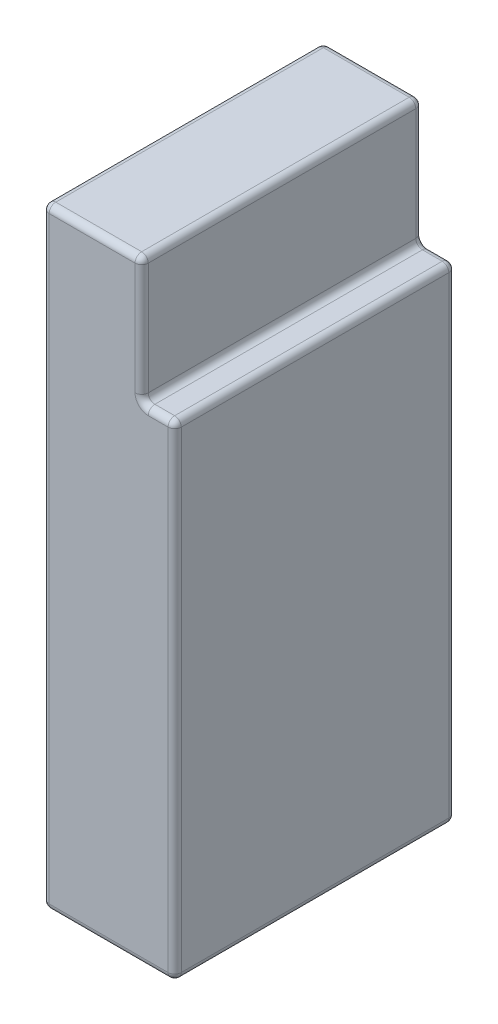
ISO-10303-21;
HEADER;
FILE_DESCRIPTION(('STEP AP214'),'2;1');
FILE_NAME('part.step','',(''),(''),'','','');
FILE_SCHEMA(('AUTOMOTIVE_DESIGN { 1 0 10303 214 1 1 1 1 }'));
ENDSEC;
DATA;
#1=APPLICATION_CONTEXT('core data for automotive mechanical design processes');
#2=APPLICATION_PROTOCOL_DEFINITION('international standard','automotive_design',2000,#1);
#3=PRODUCT_CONTEXT('',#1,'mechanical');
#4=PRODUCT('Part','Part','',(#3));
#5=PRODUCT_RELATED_PRODUCT_CATEGORY('part','',(#4));
#6=PRODUCT_DEFINITION_FORMATION('','',#4);
#7=PRODUCT_DEFINITION_CONTEXT('part definition',#1,'design');
#8=PRODUCT_DEFINITION('design','',#6,#7);
#9=PRODUCT_DEFINITION_SHAPE('','',#8);
#10=(LENGTH_UNIT() NAMED_UNIT(*) SI_UNIT(.MILLI.,.METRE.));
#11=(NAMED_UNIT(*) PLANE_ANGLE_UNIT() SI_UNIT($,.RADIAN.));
#12=(NAMED_UNIT(*) SI_UNIT($,.STERADIAN.) SOLID_ANGLE_UNIT());
#13=UNCERTAINTY_MEASURE_WITH_UNIT(LENGTH_MEASURE(1.E-05),#10,'distance_accuracy_value','');
#14=(GEOMETRIC_REPRESENTATION_CONTEXT(3) GLOBAL_UNCERTAINTY_ASSIGNED_CONTEXT((#13)) GLOBAL_UNIT_ASSIGNED_CONTEXT((#10,
#11,#12)) REPRESENTATION_CONTEXT('',''));
#15=CARTESIAN_POINT('',(0.,0.,0.));
#16=DIRECTION('',(0.,0.,1.));
#17=DIRECTION('',(1.,0.,0.));
#18=AXIS2_PLACEMENT_3D('',#15,#16,#17);
#19=CARTESIAN_POINT('',(0.,92.5,0.));
#20=DIRECTION('',(0.,-1.,0.));
#21=DIRECTION('',(0.,0.,-1.));
#22=AXIS2_PLACEMENT_3D('',#19,#20,#21);
#23=PLANE('',#22);
#24=DIRECTION('',(0.,0.,1.));
#25=VECTOR('',#24,1.);
#26=CARTESIAN_POINT('',(4.,92.5,-21.25));
#27=LINE('',#26,#25);
#28=CARTESIAN_POINT('',(4.,92.5,20.25));
#29=VERTEX_POINT('',#28);
#30=CARTESIAN_POINT('',(4.,92.5,-20.25));
#31=VERTEX_POINT('',#30);
#32=EDGE_CURVE('E179',#29,#31,#27,.F.);
#33=ORIENTED_EDGE('',*,*,#32,.T.);
#34=DIRECTION('',(-1.,0.,0.));
#35=VECTOR('',#34,1.);
#36=CARTESIAN_POINT('',(0.,92.5,-20.25));
#37=LINE('',#36,#35);
#38=CARTESIAN_POINT('',(-9.,92.5,-20.25));
#39=VERTEX_POINT('',#38);
#40=EDGE_CURVE('E222',#31,#39,#37,.T.);
#41=ORIENTED_EDGE('',*,*,#40,.T.);
#42=DIRECTION('',(0.,0.,1.));
#43=VECTOR('',#42,1.);
#44=CARTESIAN_POINT('',(-9.,92.5,0.));
#45=LINE('',#44,#43);
#46=CARTESIAN_POINT('',(-9.,92.5,20.25));
#47=VERTEX_POINT('',#46);
#48=EDGE_CURVE('E182',#39,#47,#45,.T.);
#49=ORIENTED_EDGE('',*,*,#48,.T.);
#50=DIRECTION('',(1.,0.,0.));
#51=VECTOR('',#50,1.);
#52=CARTESIAN_POINT('',(0.,92.5,20.25));
#53=LINE('',#52,#51);
#54=EDGE_CURVE('E175',#47,#29,#53,.T.);
#55=ORIENTED_EDGE('',*,*,#54,.T.);
#56=EDGE_LOOP('',(#33,#41,#49,#55));
#57=FACE_BOUND('',#56,.T.);
#58=ADVANCED_FACE('F45',(#57),#23,.F.);
#59=CARTESIAN_POINT('',(10.,92.5,21.25));
#60=DIRECTION('',(-1.,0.,0.));
#61=DIRECTION('',(0.,0.,1.));
#62=AXIS2_PLACEMENT_3D('',#59,#60,#61);
#63=PLANE('',#62);
#64=DIRECTION('',(0.,-1.,0.));
#65=VECTOR('',#64,1.);
#66=CARTESIAN_POINT('',(10.,92.5,20.25));
#67=LINE('',#66,#65);
#68=CARTESIAN_POINT('',(10.,72.5,20.25));
#69=VERTEX_POINT('',#68);
#70=CARTESIAN_POINT('',(10.,1.,20.25));
#71=VERTEX_POINT('',#70);
#72=EDGE_CURVE('E55',#69,#71,#67,.T.);
#73=ORIENTED_EDGE('',*,*,#72,.T.);
#74=DIRECTION('',(0.,0.,-1.));
#75=VECTOR('',#74,1.);
#76=CARTESIAN_POINT('',(10.,1.,-21.25));
#77=LINE('',#76,#75);
#78=CARTESIAN_POINT('',(10.,1.,-20.25));
#79=VERTEX_POINT('',#78);
#80=EDGE_CURVE('E11',#71,#79,#77,.T.);
#81=ORIENTED_EDGE('',*,*,#80,.T.);
#82=DIRECTION('',(0.,-1.,0.));
#83=VECTOR('',#82,1.);
#84=CARTESIAN_POINT('',(10.,92.5,-20.25));
#85=LINE('',#84,#83);
#86=CARTESIAN_POINT('',(10.,72.5,-20.25));
#87=VERTEX_POINT('',#86);
#88=EDGE_CURVE('E322',#79,#87,#85,.F.);
#89=ORIENTED_EDGE('',*,*,#88,.T.);
#90=DIRECTION('',(0.,0.,-1.));
#91=VECTOR('',#90,1.);
#92=CARTESIAN_POINT('',(10.,72.5,21.25));
#93=LINE('',#92,#91);
#94=EDGE_CURVE('E66',#87,#69,#93,.F.);
#95=ORIENTED_EDGE('',*,*,#94,.T.);
#96=EDGE_LOOP('',(#73,#81,#89,#95));
#97=FACE_BOUND('',#96,.T.);
#98=ADVANCED_FACE('F495',(#97),#63,.F.);
#99=CARTESIAN_POINT('',(-10.,92.5,-21.25));
#100=DIRECTION('',(0.,0.,1.));
#101=DIRECTION('',(1.,0.,0.));
#102=AXIS2_PLACEMENT_3D('',#99,#100,#101);
#103=PLANE('',#102);
#104=DIRECTION('',(0.,-1.,0.));
#105=VECTOR('',#104,1.);
#106=CARTESIAN_POINT('',(-9.,92.5,-21.25));
#107=LINE('',#106,#105);
#108=CARTESIAN_POINT('',(-9.,1.,-21.25));
#109=VERTEX_POINT('',#108);
#110=CARTESIAN_POINT('',(-9.,91.5,-21.25));
#111=VERTEX_POINT('',#110);
#112=EDGE_CURVE('E241',#109,#111,#107,.F.);
#113=ORIENTED_EDGE('',*,*,#112,.T.);
#114=DIRECTION('',(-1.,0.,0.));
#115=VECTOR('',#114,1.);
#116=CARTESIAN_POINT('',(-10.,91.5,-21.25));
#117=LINE('',#116,#115);
#118=CARTESIAN_POINT('',(4.,91.5,-21.25));
#119=VERTEX_POINT('',#118);
#120=EDGE_CURVE('E244',#111,#119,#117,.F.);
#121=ORIENTED_EDGE('',*,*,#120,.T.);
#122=DIRECTION('',(0.,1.,0.));
#123=VECTOR('',#122,1.);
#124=CARTESIAN_POINT('',(4.,73.5,-21.25));
#125=LINE('',#124,#123);
#126=CARTESIAN_POINT('',(4.,74.5,-21.25));
#127=VERTEX_POINT('',#126);
#128=EDGE_CURVE('E238',#119,#127,#125,.F.);
#129=ORIENTED_EDGE('',*,*,#128,.T.);
#130=CARTESIAN_POINT('',(6.,74.5,-21.25));
#131=DIRECTION('',(0.,0.,1.));
#132=DIRECTION('',(1.,0.,0.));
#133=AXIS2_PLACEMENT_3D('',#130,#131,#132);
#134=CIRCLE('',#133,2.);
#135=CARTESIAN_POINT('',(6.,72.5,-21.25));
#136=VERTEX_POINT('',#135);
#137=EDGE_CURVE('E234',#136,#127,#134,.F.);
#138=ORIENTED_EDGE('',*,*,#137,.F.);
#139=DIRECTION('',(1.,0.,0.));
#140=VECTOR('',#139,1.);
#141=CARTESIAN_POINT('',(-10.,72.5,-21.25));
#142=LINE('',#141,#140);
#143=CARTESIAN_POINT('',(9.,72.5,-21.25));
#144=VERTEX_POINT('',#143);
#145=EDGE_CURVE('E228',#136,#144,#142,.T.);
#146=ORIENTED_EDGE('',*,*,#145,.T.);
#147=DIRECTION('',(0.,-1.,0.));
#148=VECTOR('',#147,1.);
#149=CARTESIAN_POINT('',(9.,92.5,-21.25));
#150=LINE('',#149,#148);
#151=CARTESIAN_POINT('',(9.,1.,-21.25));
#152=VERTEX_POINT('',#151);
#153=EDGE_CURVE('E225',#144,#152,#150,.T.);
#154=ORIENTED_EDGE('',*,*,#153,.T.);
#155=DIRECTION('',(-1.,0.,0.));
#156=VECTOR('',#155,1.);
#157=CARTESIAN_POINT('',(-10.,1.,-21.25));
#158=LINE('',#157,#156);
#159=EDGE_CURVE('E231',#152,#109,#158,.T.);
#160=ORIENTED_EDGE('',*,*,#159,.T.);
#161=EDGE_LOOP('',(#113,#121,#129,#138,#146,#154,#160));
#162=FACE_BOUND('',#161,.T.);
#163=ADVANCED_FACE('F535',(#162),#103,.F.);
#164=CARTESIAN_POINT('',(-10.,92.5,21.25));
#165=DIRECTION('',(1.,0.,0.));
#166=DIRECTION('',(0.,0.,-1.));
#167=AXIS2_PLACEMENT_3D('',#164,#165,#166);
#168=PLANE('',#167);
#169=DIRECTION('',(0.,0.,1.));
#170=VECTOR('',#169,1.);
#171=CARTESIAN_POINT('',(-10.,91.5,21.25));
#172=LINE('',#171,#170);
#173=CARTESIAN_POINT('',(-10.,91.5,20.25));
#174=VERTEX_POINT('',#173);
#175=CARTESIAN_POINT('',(-10.,91.5,-20.25));
#176=VERTEX_POINT('',#175);
#177=EDGE_CURVE('E280',#174,#176,#172,.F.);
#178=ORIENTED_EDGE('',*,*,#177,.T.);
#179=DIRECTION('',(0.,-1.,0.));
#180=VECTOR('',#179,1.);
#181=CARTESIAN_POINT('',(-10.,92.5,-20.25));
#182=LINE('',#181,#180);
#183=CARTESIAN_POINT('',(-10.,1.,-20.25));
#184=VERTEX_POINT('',#183);
#185=EDGE_CURVE('E283',#176,#184,#182,.T.);
#186=ORIENTED_EDGE('',*,*,#185,.T.);
#187=DIRECTION('',(0.,0.,1.));
#188=VECTOR('',#187,1.);
#189=CARTESIAN_POINT('',(-10.,1.,21.25));
#190=LINE('',#189,#188);
#191=CARTESIAN_POINT('',(-10.,1.,20.25));
#192=VERTEX_POINT('',#191);
#193=EDGE_CURVE('E277',#184,#192,#190,.T.);
#194=ORIENTED_EDGE('',*,*,#193,.T.);
#195=DIRECTION('',(0.,-1.,0.));
#196=VECTOR('',#195,1.);
#197=CARTESIAN_POINT('',(-10.,92.5,20.25));
#198=LINE('',#197,#196);
#199=EDGE_CURVE('E274',#192,#174,#198,.F.);
#200=ORIENTED_EDGE('',*,*,#199,.T.);
#201=EDGE_LOOP('',(#178,#186,#194,#200));
#202=FACE_BOUND('',#201,.T.);
#203=ADVANCED_FACE('F471',(#202),#168,.F.);
#204=CARTESIAN_POINT('',(-10.,92.5,21.25));
#205=DIRECTION('',(0.,0.,-1.));
#206=DIRECTION('',(-1.,0.,0.));
#207=AXIS2_PLACEMENT_3D('',#204,#205,#206);
#208=PLANE('',#207);
#209=DIRECTION('',(0.,-1.,0.));
#210=VECTOR('',#209,1.);
#211=CARTESIAN_POINT('',(4.,92.5,21.25));
#212=LINE('',#211,#210);
#213=CARTESIAN_POINT('',(4.,74.5,21.25));
#214=VERTEX_POINT('',#213);
#215=CARTESIAN_POINT('',(4.,91.5,21.25));
#216=VERTEX_POINT('',#215);
#217=EDGE_CURVE('E304',#214,#216,#212,.F.);
#218=ORIENTED_EDGE('',*,*,#217,.T.);
#219=DIRECTION('',(1.,0.,0.));
#220=VECTOR('',#219,1.);
#221=CARTESIAN_POINT('',(-10.,91.5,21.25));
#222=LINE('',#221,#220);
#223=CARTESIAN_POINT('',(-9.,91.5,21.25));
#224=VERTEX_POINT('',#223);
#225=EDGE_CURVE('E193',#216,#224,#222,.F.);
#226=ORIENTED_EDGE('',*,*,#225,.T.);
#227=DIRECTION('',(0.,-1.,0.));
#228=VECTOR('',#227,1.);
#229=CARTESIAN_POINT('',(-9.,92.5,21.25));
#230=LINE('',#229,#228);
#231=CARTESIAN_POINT('',(-9.,1.,21.25));
#232=VERTEX_POINT('',#231);
#233=EDGE_CURVE('E301',#224,#232,#230,.T.);
#234=ORIENTED_EDGE('',*,*,#233,.T.);
#235=DIRECTION('',(1.,0.,0.));
#236=VECTOR('',#235,1.);
#237=CARTESIAN_POINT('',(10.,1.,21.25));
#238=LINE('',#237,#236);
#239=CARTESIAN_POINT('',(9.,1.,21.25));
#240=VERTEX_POINT('',#239);
#241=EDGE_CURVE('E293',#232,#240,#238,.T.);
#242=ORIENTED_EDGE('',*,*,#241,.T.);
#243=DIRECTION('',(0.,-1.,0.));
#244=VECTOR('',#243,1.);
#245=CARTESIAN_POINT('',(9.,92.5,21.25));
#246=LINE('',#245,#244);
#247=CARTESIAN_POINT('',(9.,72.5,21.25));
#248=VERTEX_POINT('',#247);
#249=EDGE_CURVE('E287',#240,#248,#246,.F.);
#250=ORIENTED_EDGE('',*,*,#249,.T.);
#251=DIRECTION('',(1.,0.,0.));
#252=VECTOR('',#251,1.);
#253=CARTESIAN_POINT('',(-10.,72.5,21.25));
#254=LINE('',#253,#252);
#255=CARTESIAN_POINT('',(6.,72.5,21.25));
#256=VERTEX_POINT('',#255);
#257=EDGE_CURVE('E290',#248,#256,#254,.F.);
#258=ORIENTED_EDGE('',*,*,#257,.T.);
#259=CARTESIAN_POINT('',(6.,74.5,21.25));
#260=DIRECTION('',(0.,0.,-1.));
#261=DIRECTION('',(-1.,0.,0.));
#262=AXIS2_PLACEMENT_3D('',#259,#260,#261);
#263=CIRCLE('',#262,2.);
#264=EDGE_CURVE('E297',#214,#256,#263,.F.);
#265=ORIENTED_EDGE('',*,*,#264,.F.);
#266=EDGE_LOOP('',(#218,#226,#234,#242,#250,#258,#265));
#267=FACE_BOUND('',#266,.T.);
#268=ADVANCED_FACE('F455',(#267),#208,.F.);
#269=CARTESIAN_POINT('',(0.,0.,0.));
#270=DIRECTION('',(0.,-1.,0.));
#271=DIRECTION('',(0.,0.,-1.));
#272=AXIS2_PLACEMENT_3D('',#269,#270,#271);
#273=PLANE('',#272);
#274=DIRECTION('',(0.,0.,1.));
#275=VECTOR('',#274,1.);
#276=CARTESIAN_POINT('',(-9.,0.,-21.25));
#277=LINE('',#276,#275);
#278=CARTESIAN_POINT('',(-9.,0.,20.25));
#279=VERTEX_POINT('',#278);
#280=CARTESIAN_POINT('',(-9.,0.,-20.25));
#281=VERTEX_POINT('',#280);
#282=EDGE_CURVE('E254',#279,#281,#277,.F.);
#283=ORIENTED_EDGE('',*,*,#282,.T.);
#284=DIRECTION('',(-1.,0.,0.));
#285=VECTOR('',#284,1.);
#286=CARTESIAN_POINT('',(10.,0.,-20.25));
#287=LINE('',#286,#285);
#288=CARTESIAN_POINT('',(9.,0.,-20.25));
#289=VERTEX_POINT('',#288);
#290=EDGE_CURVE('E257',#281,#289,#287,.F.);
#291=ORIENTED_EDGE('',*,*,#290,.T.);
#292=DIRECTION('',(0.,0.,-1.));
#293=VECTOR('',#292,1.);
#294=CARTESIAN_POINT('',(9.,0.,21.25));
#295=LINE('',#294,#293);
#296=CARTESIAN_POINT('',(9.,0.,20.25));
#297=VERTEX_POINT('',#296);
#298=EDGE_CURVE('E248',#289,#297,#295,.F.);
#299=ORIENTED_EDGE('',*,*,#298,.T.);
#300=DIRECTION('',(1.,0.,0.));
#301=VECTOR('',#300,1.);
#302=CARTESIAN_POINT('',(-10.,0.,20.25));
#303=LINE('',#302,#301);
#304=EDGE_CURVE('E251',#297,#279,#303,.F.);
#305=ORIENTED_EDGE('',*,*,#304,.T.);
#306=EDGE_LOOP('',(#283,#291,#299,#305));
#307=FACE_BOUND('',#306,.T.);
#308=ADVANCED_FACE('F480',(#307),#273,.T.);
#309=CARTESIAN_POINT('',(5.,73.5,21.25));
#310=DIRECTION('',(0.,-1.,0.));
#311=DIRECTION('',(0.,0.,-1.));
#312=AXIS2_PLACEMENT_3D('',#309,#310,#311);
#313=PLANE('',#312);
#314=DIRECTION('',(1.,0.,0.));
#315=VECTOR('',#314,1.);
#316=CARTESIAN_POINT('',(5.,73.5,-20.25));
#317=LINE('',#316,#315);
#318=CARTESIAN_POINT('',(9.,73.5,-20.25));
#319=VERTEX_POINT('',#318);
#320=CARTESIAN_POINT('',(6.,73.5,-20.25));
#321=VERTEX_POINT('',#320);
#322=EDGE_CURVE('E267',#319,#321,#317,.F.);
#323=ORIENTED_EDGE('',*,*,#322,.T.);
#324=DIRECTION('',(0.,0.,-1.));
#325=VECTOR('',#324,1.);
#326=CARTESIAN_POINT('',(6.,73.5,21.25));
#327=LINE('',#326,#325);
#328=CARTESIAN_POINT('',(6.,73.5,20.25));
#329=VERTEX_POINT('',#328);
#330=EDGE_CURVE('E271',#321,#329,#327,.F.);
#331=ORIENTED_EDGE('',*,*,#330,.T.);
#332=DIRECTION('',(1.,0.,0.));
#333=VECTOR('',#332,1.);
#334=CARTESIAN_POINT('',(5.,73.5,20.25));
#335=LINE('',#334,#333);
#336=CARTESIAN_POINT('',(9.,73.5,20.25));
#337=VERTEX_POINT('',#336);
#338=EDGE_CURVE('E264',#329,#337,#335,.T.);
#339=ORIENTED_EDGE('',*,*,#338,.T.);
#340=DIRECTION('',(0.,0.,-1.));
#341=VECTOR('',#340,1.);
#342=CARTESIAN_POINT('',(9.,73.5,21.25));
#343=LINE('',#342,#341);
#344=EDGE_CURVE('E261',#337,#319,#343,.T.);
#345=ORIENTED_EDGE('',*,*,#344,.T.);
#346=EDGE_LOOP('',(#323,#331,#339,#345));
#347=FACE_BOUND('',#346,.T.);
#348=ADVANCED_FACE('F515',(#347),#313,.F.);
#349=CARTESIAN_POINT('',(5.,0.,0.));
#350=DIRECTION('',(1.,0.,0.));
#351=DIRECTION('',(0.,0.,-1.));
#352=AXIS2_PLACEMENT_3D('',#349,#350,#351);
#353=PLANE('',#352);
#354=DIRECTION('',(0.,1.,0.));
#355=VECTOR('',#354,1.);
#356=CARTESIAN_POINT('',(5.,92.5,-20.25));
#357=LINE('',#356,#355);
#358=CARTESIAN_POINT('',(5.,74.5,-20.25));
#359=VERTEX_POINT('',#358);
#360=CARTESIAN_POINT('',(5.,91.5,-20.25));
#361=VERTEX_POINT('',#360);
#362=EDGE_CURVE('E315',#359,#361,#357,.T.);
#363=ORIENTED_EDGE('',*,*,#362,.T.);
#364=DIRECTION('',(0.,0.,1.));
#365=VECTOR('',#364,1.);
#366=CARTESIAN_POINT('',(5.,91.5,21.25));
#367=LINE('',#366,#365);
#368=CARTESIAN_POINT('',(5.,91.5,20.25));
#369=VERTEX_POINT('',#368);
#370=EDGE_CURVE('E318',#361,#369,#367,.T.);
#371=ORIENTED_EDGE('',*,*,#370,.T.);
#372=DIRECTION('',(0.,-1.,0.));
#373=VECTOR('',#372,1.);
#374=CARTESIAN_POINT('',(5.,73.5,20.25));
#375=LINE('',#374,#373);
#376=CARTESIAN_POINT('',(5.,74.5,20.25));
#377=VERTEX_POINT('',#376);
#378=EDGE_CURVE('E309',#369,#377,#375,.T.);
#379=ORIENTED_EDGE('',*,*,#378,.T.);
#380=DIRECTION('',(0.,0.,-1.));
#381=VECTOR('',#380,1.);
#382=CARTESIAN_POINT('',(5.,74.5,0.));
#383=LINE('',#382,#381);
#384=EDGE_CURVE('E312',#377,#359,#383,.T.);
#385=ORIENTED_EDGE('',*,*,#384,.T.);
#386=EDGE_LOOP('',(#363,#371,#379,#385));
#387=FACE_BOUND('',#386,.T.);
#388=ADVANCED_FACE('F529',(#387),#353,.T.);
#389=CARTESIAN_POINT('',(9.,92.5,20.25));
#390=DIRECTION('',(0.,-1.,0.));
#391=DIRECTION('',(0.,0.,-1.));
#392=AXIS2_PLACEMENT_3D('',#389,#390,#391);
#393=CYLINDRICAL_SURFACE('',#392,1.);
#394=CARTESIAN_POINT('',(9.,72.5,20.25));
#395=DIRECTION('',(0.,1.,0.));
#396=DIRECTION('',(0.,0.,1.));
#397=AXIS2_PLACEMENT_3D('',#394,#395,#396);
#398=CIRCLE('',#397,1.);
#399=EDGE_CURVE('E49',#248,#69,#398,.T.);
#400=ORIENTED_EDGE('',*,*,#399,.F.);
#401=ORIENTED_EDGE('',*,*,#249,.F.);
#402=CARTESIAN_POINT('',(9.,1.,20.25));
#403=DIRECTION('',(0.,-1.,0.));
#404=DIRECTION('',(0.,0.,-1.));
#405=AXIS2_PLACEMENT_3D('',#402,#403,#404);
#406=CIRCLE('',#405,1.);
#407=EDGE_CURVE('E218',#71,#240,#406,.T.);
#408=ORIENTED_EDGE('',*,*,#407,.F.);
#409=ORIENTED_EDGE('',*,*,#72,.F.);
#410=EDGE_LOOP('',(#400,#401,#408,#409));
#411=FACE_BOUND('',#410,.T.);
#412=ADVANCED_FACE('F47',(#411),#393,.T.);
#413=CARTESIAN_POINT('',(9.,72.5,20.25));
#414=DIRECTION('',(1.,0.,0.));
#415=DIRECTION('',(0.,0.,-1.));
#416=AXIS2_PLACEMENT_3D('',#413,#414,#415);
#417=SPHERICAL_SURFACE('',#416,1.);
#418=CARTESIAN_POINT('',(9.,72.5,20.25));
#419=DIRECTION('',(1.,0.,0.));
#420=DIRECTION('',(0.,0.,-1.));
#421=AXIS2_PLACEMENT_3D('',#418,#419,#420);
#422=CIRCLE('',#421,1.);
#423=EDGE_CURVE('E434',#248,#337,#422,.F.);
#424=ORIENTED_EDGE('',*,*,#423,.F.);
#425=ORIENTED_EDGE('',*,*,#399,.T.);
#426=CARTESIAN_POINT('',(9.,72.5,20.25));
#427=DIRECTION('',(0.,0.,1.));
#428=DIRECTION('',(1.,0.,0.));
#429=AXIS2_PLACEMENT_3D('',#426,#427,#428);
#430=CIRCLE('',#429,1.);
#431=EDGE_CURVE('E438',#337,#69,#430,.F.);
#432=ORIENTED_EDGE('',*,*,#431,.F.);
#433=EDGE_LOOP('',(#424,#425,#432));
#434=FACE_BOUND('',#433,.T.);
#435=ADVANCED_FACE('F522',(#434),#417,.T.);
#436=CARTESIAN_POINT('',(9.,1.,20.25));
#437=DIRECTION('',(0.,0.,1.));
#438=DIRECTION('',(0.,-1.,0.));
#439=AXIS2_PLACEMENT_3D('',#436,#437,#438);
#440=SPHERICAL_SURFACE('',#439,1.);
#441=CARTESIAN_POINT('',(9.,1.,20.25));
#442=DIRECTION('',(0.,0.,1.));
#443=DIRECTION('',(1.,0.,0.));
#444=AXIS2_PLACEMENT_3D('',#441,#442,#443);
#445=CIRCLE('',#444,1.);
#446=EDGE_CURVE('E427',#71,#297,#445,.F.);
#447=ORIENTED_EDGE('',*,*,#446,.F.);
#448=ORIENTED_EDGE('',*,*,#407,.T.);
#449=CARTESIAN_POINT('',(9.,1.,20.25));
#450=DIRECTION('',(1.,0.,0.));
#451=DIRECTION('',(0.,0.,-1.));
#452=AXIS2_PLACEMENT_3D('',#449,#450,#451);
#453=CIRCLE('',#452,1.);
#454=EDGE_CURVE('E431',#297,#240,#453,.F.);
#455=ORIENTED_EDGE('',*,*,#454,.F.);
#456=EDGE_LOOP('',(#447,#448,#455));
#457=FACE_BOUND('',#456,.T.);
#458=ADVANCED_FACE('F447',(#457),#440,.T.);
#459=CARTESIAN_POINT('',(9.,72.5,21.25));
#460=DIRECTION('',(0.,0.,-1.));
#461=DIRECTION('',(-1.,0.,0.));
#462=AXIS2_PLACEMENT_3D('',#459,#460,#461);
#463=CYLINDRICAL_SURFACE('',#462,1.);
#464=ORIENTED_EDGE('',*,*,#431,.T.);
#465=ORIENTED_EDGE('',*,*,#94,.F.);
#466=CARTESIAN_POINT('',(9.,72.5,-20.25));
#467=DIRECTION('',(0.,0.,-1.));
#468=DIRECTION('',(-1.,0.,0.));
#469=AXIS2_PLACEMENT_3D('',#466,#467,#468);
#470=CIRCLE('',#469,1.);
#471=EDGE_CURVE('E419',#319,#87,#470,.T.);
#472=ORIENTED_EDGE('',*,*,#471,.F.);
#473=ORIENTED_EDGE('',*,*,#344,.F.);
#474=EDGE_LOOP('',(#464,#465,#472,#473));
#475=FACE_BOUND('',#474,.T.);
#476=ADVANCED_FACE('F500',(#475),#463,.T.);
#477=CARTESIAN_POINT('',(5.,72.5,20.25));
#478=DIRECTION('',(1.,0.,0.));
#479=DIRECTION('',(0.,0.,-1.));
#480=AXIS2_PLACEMENT_3D('',#477,#478,#479);
#481=CYLINDRICAL_SURFACE('',#480,1.);
#482=ORIENTED_EDGE('',*,*,#423,.T.);
#483=ORIENTED_EDGE('',*,*,#338,.F.);
#484=CARTESIAN_POINT('',(6.,72.5,20.25));
#485=DIRECTION('',(-1.,0.,0.));
#486=DIRECTION('',(0.,0.,1.));
#487=AXIS2_PLACEMENT_3D('',#484,#485,#486);
#488=CIRCLE('',#487,1.);
#489=EDGE_CURVE('E415',#256,#329,#488,.T.);
#490=ORIENTED_EDGE('',*,*,#489,.F.);
#491=ORIENTED_EDGE('',*,*,#257,.F.);
#492=EDGE_LOOP('',(#482,#483,#490,#491));
#493=FACE_BOUND('',#492,.T.);
#494=ADVANCED_FACE('F520',(#493),#481,.T.);
#495=CARTESIAN_POINT('',(-10.,1.,20.25));
#496=DIRECTION('',(-1.,0.,0.));
#497=DIRECTION('',(0.,0.,1.));
#498=AXIS2_PLACEMENT_3D('',#495,#496,#497);
#499=CYLINDRICAL_SURFACE('',#498,1.);
#500=ORIENTED_EDGE('',*,*,#454,.T.);
#501=ORIENTED_EDGE('',*,*,#241,.F.);
#502=CARTESIAN_POINT('',(-9.,1.,20.25));
#503=DIRECTION('',(-1.,0.,0.));
#504=DIRECTION('',(0.,0.,1.));
#505=AXIS2_PLACEMENT_3D('',#502,#503,#504);
#506=CIRCLE('',#505,1.);
#507=EDGE_CURVE('E411',#279,#232,#506,.T.);
#508=ORIENTED_EDGE('',*,*,#507,.F.);
#509=ORIENTED_EDGE('',*,*,#304,.F.);
#510=EDGE_LOOP('',(#500,#501,#508,#509));
#511=FACE_BOUND('',#510,.T.);
#512=ADVANCED_FACE('F459',(#511),#499,.T.);
#513=CARTESIAN_POINT('',(9.,1.,21.25));
#514=DIRECTION('',(0.,0.,1.));
#515=DIRECTION('',(1.,0.,0.));
#516=AXIS2_PLACEMENT_3D('',#513,#514,#515);
#517=CYLINDRICAL_SURFACE('',#516,1.);
#518=ORIENTED_EDGE('',*,*,#446,.T.);
#519=ORIENTED_EDGE('',*,*,#298,.F.);
#520=CARTESIAN_POINT('',(9.,1.,-20.25));
#521=DIRECTION('',(0.,0.,-1.));
#522=DIRECTION('',(-1.,0.,0.));
#523=AXIS2_PLACEMENT_3D('',#520,#521,#522);
#524=CIRCLE('',#523,1.);
#525=EDGE_CURVE('E407',#79,#289,#524,.T.);
#526=ORIENTED_EDGE('',*,*,#525,.F.);
#527=ORIENTED_EDGE('',*,*,#80,.F.);
#528=EDGE_LOOP('',(#518,#519,#526,#527));
#529=FACE_BOUND('',#528,.T.);
#530=ADVANCED_FACE('F494',(#529),#517,.T.);
#531=CARTESIAN_POINT('',(9.,92.5,-20.25));
#532=DIRECTION('',(0.,-1.,0.));
#533=DIRECTION('',(0.,0.,-1.));
#534=AXIS2_PLACEMENT_3D('',#531,#532,#533);
#535=CYLINDRICAL_SURFACE('',#534,1.);
#536=CARTESIAN_POINT('',(9.,72.5,-20.25));
#537=DIRECTION('',(0.,1.,0.));
#538=DIRECTION('',(0.,0.,1.));
#539=AXIS2_PLACEMENT_3D('',#536,#537,#538);
#540=CIRCLE('',#539,1.);
#541=EDGE_CURVE('E423',#87,#144,#540,.T.);
#542=ORIENTED_EDGE('',*,*,#541,.F.);
#543=ORIENTED_EDGE('',*,*,#88,.F.);
#544=CARTESIAN_POINT('',(9.,1.,-20.25));
#545=DIRECTION('',(0.,-1.,0.));
#546=DIRECTION('',(0.,0.,-1.));
#547=AXIS2_PLACEMENT_3D('',#544,#545,#546);
#548=CIRCLE('',#547,1.);
#549=EDGE_CURVE('E404',#152,#79,#548,.T.);
#550=ORIENTED_EDGE('',*,*,#549,.F.);
#551=ORIENTED_EDGE('',*,*,#153,.F.);
#552=EDGE_LOOP('',(#542,#543,#550,#551));
#553=FACE_BOUND('',#552,.T.);
#554=ADVANCED_FACE('F505',(#553),#535,.T.);
#555=CARTESIAN_POINT('',(9.,72.5,-20.25));
#556=DIRECTION('',(1.,0.,0.));
#557=DIRECTION('',(0.,0.,-1.));
#558=AXIS2_PLACEMENT_3D('',#555,#556,#557);
#559=SPHERICAL_SURFACE('',#558,1.);
#560=ORIENTED_EDGE('',*,*,#471,.T.);
#561=ORIENTED_EDGE('',*,*,#541,.T.);
#562=CARTESIAN_POINT('',(9.,72.5,-20.25));
#563=DIRECTION('',(1.,0.,0.));
#564=DIRECTION('',(0.,1.,0.));
#565=AXIS2_PLACEMENT_3D('',#562,#563,#564);
#566=CIRCLE('',#565,1.);
#567=EDGE_CURVE('E400',#319,#144,#566,.F.);
#568=ORIENTED_EDGE('',*,*,#567,.F.);
#569=EDGE_LOOP('',(#560,#561,#568));
#570=FACE_BOUND('',#569,.T.);
#571=ADVANCED_FACE('F507',(#570),#559,.T.);
#572=CARTESIAN_POINT('',(6.,74.5,20.25));
#573=DIRECTION('',(0.,0.,-1.));
#574=DIRECTION('',(-1.,0.,0.));
#575=AXIS2_PLACEMENT_3D('',#572,#573,#574);
#576=TOROIDAL_SURFACE('',#575,2.,1.);
#577=ORIENTED_EDGE('',*,*,#264,.T.);
#578=ORIENTED_EDGE('',*,*,#489,.T.);
#579=CARTESIAN_POINT('',(6.,74.5,20.25));
#580=DIRECTION('',(0.,0.,-1.));
#581=DIRECTION('',(-1.,0.,0.));
#582=AXIS2_PLACEMENT_3D('',#579,#580,#581);
#583=CIRCLE('',#582,1.);
#584=EDGE_CURVE('E396',#377,#329,#583,.F.);
#585=ORIENTED_EDGE('',*,*,#584,.F.);
#586=CARTESIAN_POINT('',(4.,74.5,20.25));
#587=DIRECTION('',(0.,-1.,0.));
#588=DIRECTION('',(0.,0.,-1.));
#589=AXIS2_PLACEMENT_3D('',#586,#587,#588);
#590=CIRCLE('',#589,1.);
#591=EDGE_CURVE('E392',#214,#377,#590,.F.);
#592=ORIENTED_EDGE('',*,*,#591,.F.);
#593=EDGE_LOOP('',(#577,#578,#585,#592));
#594=FACE_BOUND('',#593,.T.);
#595=ADVANCED_FACE('F611',(#594),#576,.T.);
#596=CARTESIAN_POINT('',(-9.,1.,20.25));
#597=DIRECTION('',(0.,0.,1.));
#598=DIRECTION('',(0.,-1.,0.));
#599=AXIS2_PLACEMENT_3D('',#596,#597,#598);
#600=SPHERICAL_SURFACE('',#599,1.);
#601=CARTESIAN_POINT('',(-9.,1.,20.25));
#602=DIRECTION('',(0.,0.,1.));
#603=DIRECTION('',(1.,0.,0.));
#604=AXIS2_PLACEMENT_3D('',#601,#602,#603);
#605=CIRCLE('',#604,1.);
#606=EDGE_CURVE('E384',#279,#192,#605,.F.);
#607=ORIENTED_EDGE('',*,*,#606,.F.);
#608=ORIENTED_EDGE('',*,*,#507,.T.);
#609=CARTESIAN_POINT('',(-9.,1.,20.25));
#610=DIRECTION('',(0.,-1.,0.));
#611=DIRECTION('',(0.,0.,-1.));
#612=AXIS2_PLACEMENT_3D('',#609,#610,#611);
#613=CIRCLE('',#612,1.);
#614=EDGE_CURVE('E388',#192,#232,#613,.F.);
#615=ORIENTED_EDGE('',*,*,#614,.F.);
#616=EDGE_LOOP('',(#607,#608,#615));
#617=FACE_BOUND('',#616,.T.);
#618=ADVANCED_FACE('F463',(#617),#600,.T.);
#619=CARTESIAN_POINT('',(9.,1.,-20.25));
#620=DIRECTION('',(1.,0.,0.));
#621=DIRECTION('',(0.,1.,0.));
#622=AXIS2_PLACEMENT_3D('',#619,#620,#621);
#623=SPHERICAL_SURFACE('',#622,1.);
#624=ORIENTED_EDGE('',*,*,#549,.T.);
#625=ORIENTED_EDGE('',*,*,#525,.T.);
#626=CARTESIAN_POINT('',(9.,1.,-20.25));
#627=DIRECTION('',(1.,0.,0.));
#628=DIRECTION('',(0.,0.,-1.));
#629=AXIS2_PLACEMENT_3D('',#626,#627,#628);
#630=CIRCLE('',#629,1.);
#631=EDGE_CURVE('E381',#152,#289,#630,.F.);
#632=ORIENTED_EDGE('',*,*,#631,.F.);
#633=EDGE_LOOP('',(#624,#625,#632));
#634=FACE_BOUND('',#633,.T.);
#635=ADVANCED_FACE('F490',(#634),#623,.T.);
#636=CARTESIAN_POINT('',(-10.,72.5,-20.25));
#637=DIRECTION('',(1.,0.,0.));
#638=DIRECTION('',(0.,0.,-1.));
#639=AXIS2_PLACEMENT_3D('',#636,#637,#638);
#640=CYLINDRICAL_SURFACE('',#639,1.);
#641=ORIENTED_EDGE('',*,*,#567,.T.);
#642=ORIENTED_EDGE('',*,*,#145,.F.);
#643=CARTESIAN_POINT('',(6.,72.5,-20.25));
#644=DIRECTION('',(-1.,0.,0.));
#645=DIRECTION('',(0.,0.,1.));
#646=AXIS2_PLACEMENT_3D('',#643,#644,#645);
#647=CIRCLE('',#646,1.);
#648=EDGE_CURVE('E377',#321,#136,#647,.T.);
#649=ORIENTED_EDGE('',*,*,#648,.F.);
#650=ORIENTED_EDGE('',*,*,#322,.F.);
#651=EDGE_LOOP('',(#641,#642,#649,#650));
#652=FACE_BOUND('',#651,.T.);
#653=ADVANCED_FACE('F512',(#652),#640,.T.);
#654=CARTESIAN_POINT('',(6.,74.5,0.));
#655=DIRECTION('',(0.,0.,-1.));
#656=DIRECTION('',(-1.,0.,0.));
#657=AXIS2_PLACEMENT_3D('',#654,#655,#656);
#658=CYLINDRICAL_SURFACE('',#657,1.);
#659=ORIENTED_EDGE('',*,*,#584,.T.);
#660=ORIENTED_EDGE('',*,*,#330,.F.);
#661=CARTESIAN_POINT('',(6.,74.5,-20.25));
#662=DIRECTION('',(0.,0.,1.));
#663=DIRECTION('',(1.,0.,0.));
#664=AXIS2_PLACEMENT_3D('',#661,#662,#663);
#665=CIRCLE('',#664,1.);
#666=EDGE_CURVE('E374',#359,#321,#665,.T.);
#667=ORIENTED_EDGE('',*,*,#666,.F.);
#668=ORIENTED_EDGE('',*,*,#384,.F.);
#669=EDGE_LOOP('',(#659,#660,#667,#668));
#670=FACE_BOUND('',#669,.T.);
#671=ADVANCED_FACE('F600',(#670),#658,.F.);
#672=CARTESIAN_POINT('',(4.,0.,20.25));
#673=DIRECTION('',(0.,1.,0.));
#674=DIRECTION('',(0.,0.,1.));
#675=AXIS2_PLACEMENT_3D('',#672,#673,#674);
#676=CYLINDRICAL_SURFACE('',#675,1.);
#677=ORIENTED_EDGE('',*,*,#591,.T.);
#678=ORIENTED_EDGE('',*,*,#378,.F.);
#679=CARTESIAN_POINT('',(4.,91.5,20.25));
#680=DIRECTION('',(0.,1.,0.));
#681=DIRECTION('',(0.,0.,1.));
#682=AXIS2_PLACEMENT_3D('',#679,#680,#681);
#683=CIRCLE('',#682,1.);
#684=EDGE_CURVE('E198',#216,#369,#683,.T.);
#685=ORIENTED_EDGE('',*,*,#684,.F.);
#686=ORIENTED_EDGE('',*,*,#217,.F.);
#687=EDGE_LOOP('',(#677,#678,#685,#686));
#688=FACE_BOUND('',#687,.T.);
#689=ADVANCED_FACE('F597',(#688),#676,.T.);
#690=CARTESIAN_POINT('',(0.,91.5,20.25));
#691=DIRECTION('',(1.,0.,0.));
#692=DIRECTION('',(0.,0.,-1.));
#693=AXIS2_PLACEMENT_3D('',#690,#691,#692);
#694=CYLINDRICAL_SURFACE('',#693,1.);
#695=CARTESIAN_POINT('',(-9.,91.5,20.25));
#696=DIRECTION('',(-1.,0.,0.));
#697=DIRECTION('',(0.,0.,1.));
#698=AXIS2_PLACEMENT_3D('',#695,#696,#697);
#699=CIRCLE('',#698,1.);
#700=EDGE_CURVE('E199',#224,#47,#699,.T.);
#701=ORIENTED_EDGE('',*,*,#700,.F.);
#702=ORIENTED_EDGE('',*,*,#225,.F.);
#703=CARTESIAN_POINT('',(4.,91.5,20.25));
#704=DIRECTION('',(1.,0.,0.));
#705=DIRECTION('',(0.,0.,-1.));
#706=AXIS2_PLACEMENT_3D('',#703,#704,#705);
#707=CIRCLE('',#706,1.);
#708=EDGE_CURVE('E190',#29,#216,#707,.T.);
#709=ORIENTED_EDGE('',*,*,#708,.F.);
#710=ORIENTED_EDGE('',*,*,#54,.F.);
#711=EDGE_LOOP('',(#701,#702,#709,#710));
#712=FACE_BOUND('',#711,.T.);
#713=ADVANCED_FACE('F192',(#712),#694,.T.);
#714=CARTESIAN_POINT('',(-9.,92.5,20.25));
#715=DIRECTION('',(0.,-1.,0.));
#716=DIRECTION('',(0.,0.,-1.));
#717=AXIS2_PLACEMENT_3D('',#714,#715,#716);
#718=CYLINDRICAL_SURFACE('',#717,1.);
#719=ORIENTED_EDGE('',*,*,#614,.T.);
#720=ORIENTED_EDGE('',*,*,#233,.F.);
#721=CARTESIAN_POINT('',(-9.,91.5,20.25));
#722=DIRECTION('',(0.,1.,0.));
#723=DIRECTION('',(0.,0.,1.));
#724=AXIS2_PLACEMENT_3D('',#721,#722,#723);
#725=CIRCLE('',#724,1.);
#726=EDGE_CURVE('E366',#174,#224,#725,.T.);
#727=ORIENTED_EDGE('',*,*,#726,.F.);
#728=ORIENTED_EDGE('',*,*,#199,.F.);
#729=EDGE_LOOP('',(#719,#720,#727,#728));
#730=FACE_BOUND('',#729,.T.);
#731=ADVANCED_FACE('F467',(#730),#718,.T.);
#732=CARTESIAN_POINT('',(-9.,1.,21.25));
#733=DIRECTION('',(0.,0.,-1.));
#734=DIRECTION('',(-1.,0.,0.));
#735=AXIS2_PLACEMENT_3D('',#732,#733,#734);
#736=CYLINDRICAL_SURFACE('',#735,1.);
#737=ORIENTED_EDGE('',*,*,#606,.T.);
#738=ORIENTED_EDGE('',*,*,#193,.F.);
#739=CARTESIAN_POINT('',(-9.,1.,-20.25));
#740=DIRECTION('',(0.,0.,-1.));
#741=DIRECTION('',(-1.,0.,0.));
#742=AXIS2_PLACEMENT_3D('',#739,#740,#741);
#743=CIRCLE('',#742,1.);
#744=EDGE_CURVE('E362',#281,#184,#743,.T.);
#745=ORIENTED_EDGE('',*,*,#744,.F.);
#746=ORIENTED_EDGE('',*,*,#282,.F.);
#747=EDGE_LOOP('',(#737,#738,#745,#746));
#748=FACE_BOUND('',#747,.T.);
#749=ADVANCED_FACE('F477',(#748),#736,.T.);
#750=CARTESIAN_POINT('',(-10.,1.,-20.25));
#751=DIRECTION('',(1.,0.,0.));
#752=DIRECTION('',(0.,0.,-1.));
#753=AXIS2_PLACEMENT_3D('',#750,#751,#752);
#754=CYLINDRICAL_SURFACE('',#753,1.);
#755=ORIENTED_EDGE('',*,*,#631,.T.);
#756=ORIENTED_EDGE('',*,*,#290,.F.);
#757=CARTESIAN_POINT('',(-9.,1.,-20.25));
#758=DIRECTION('',(-1.,0.,0.));
#759=DIRECTION('',(0.,0.,1.));
#760=AXIS2_PLACEMENT_3D('',#757,#758,#759);
#761=CIRCLE('',#760,1.);
#762=EDGE_CURVE('E358',#109,#281,#761,.T.);
#763=ORIENTED_EDGE('',*,*,#762,.F.);
#764=ORIENTED_EDGE('',*,*,#159,.F.);
#765=EDGE_LOOP('',(#755,#756,#763,#764));
#766=FACE_BOUND('',#765,.T.);
#767=ADVANCED_FACE('F483',(#766),#754,.T.);
#768=CARTESIAN_POINT('',(6.,74.5,-20.25));
#769=DIRECTION('',(0.,0.,1.));
#770=DIRECTION('',(1.,0.,0.));
#771=AXIS2_PLACEMENT_3D('',#768,#769,#770);
#772=TOROIDAL_SURFACE('',#771,2.,1.);
#773=ORIENTED_EDGE('',*,*,#648,.T.);
#774=ORIENTED_EDGE('',*,*,#137,.T.);
#775=CARTESIAN_POINT('',(4.,74.5,-20.25));
#776=DIRECTION('',(0.,-1.,0.));
#777=DIRECTION('',(0.,0.,-1.));
#778=AXIS2_PLACEMENT_3D('',#775,#776,#777);
#779=CIRCLE('',#778,1.);
#780=EDGE_CURVE('E207',#359,#127,#779,.F.);
#781=ORIENTED_EDGE('',*,*,#780,.F.);
#782=ORIENTED_EDGE('',*,*,#666,.T.);
#783=EDGE_LOOP('',(#773,#774,#781,#782));
#784=FACE_BOUND('',#783,.T.);
#785=ADVANCED_FACE('F585',(#784),#772,.T.);
#786=CARTESIAN_POINT('',(4.,91.5,20.25));
#787=DIRECTION('',(0.,0.,1.));
#788=DIRECTION('',(1.,0.,0.));
#789=AXIS2_PLACEMENT_3D('',#786,#787,#788);
#790=SPHERICAL_SURFACE('',#789,1.);
#791=ORIENTED_EDGE('',*,*,#708,.T.);
#792=ORIENTED_EDGE('',*,*,#684,.T.);
#793=CARTESIAN_POINT('',(4.,91.5,20.25));
#794=DIRECTION('',(0.,0.,1.));
#795=DIRECTION('',(1.,0.,0.));
#796=AXIS2_PLACEMENT_3D('',#793,#794,#795);
#797=CIRCLE('',#796,1.);
#798=EDGE_CURVE('E201',#29,#369,#797,.F.);
#799=ORIENTED_EDGE('',*,*,#798,.F.);
#800=EDGE_LOOP('',(#791,#792,#799));
#801=FACE_BOUND('',#800,.T.);
#802=ADVANCED_FACE('F202',(#801),#790,.T.);
#803=CARTESIAN_POINT('',(-9.,91.5,20.25));
#804=DIRECTION('',(0.,0.,1.));
#805=DIRECTION('',(1.,0.,0.));
#806=AXIS2_PLACEMENT_3D('',#803,#804,#805);
#807=SPHERICAL_SURFACE('',#806,1.);
#808=ORIENTED_EDGE('',*,*,#726,.T.);
#809=ORIENTED_EDGE('',*,*,#700,.T.);
#810=CARTESIAN_POINT('',(-9.,91.5,20.25));
#811=DIRECTION('',(0.,0.,1.));
#812=DIRECTION('',(1.,0.,0.));
#813=AXIS2_PLACEMENT_3D('',#810,#811,#812);
#814=CIRCLE('',#813,1.);
#815=EDGE_CURVE('E208',#174,#47,#814,.F.);
#816=ORIENTED_EDGE('',*,*,#815,.F.);
#817=EDGE_LOOP('',(#808,#809,#816));
#818=FACE_BOUND('',#817,.T.);
#819=ADVANCED_FACE('F578',(#818),#807,.T.);
#820=CARTESIAN_POINT('',(-9.,1.,-20.25));
#821=DIRECTION('',(0.,-1.,0.));
#822=DIRECTION('',(0.,0.,-1.));
#823=AXIS2_PLACEMENT_3D('',#820,#821,#822);
#824=SPHERICAL_SURFACE('',#823,1.);
#825=ORIENTED_EDGE('',*,*,#762,.T.);
#826=ORIENTED_EDGE('',*,*,#744,.T.);
#827=CARTESIAN_POINT('',(-9.,1.,-20.25));
#828=DIRECTION('',(0.,-1.,0.));
#829=DIRECTION('',(0.,0.,-1.));
#830=AXIS2_PLACEMENT_3D('',#827,#828,#829);
#831=CIRCLE('',#830,1.);
#832=EDGE_CURVE('E349',#109,#184,#831,.F.);
#833=ORIENTED_EDGE('',*,*,#832,.F.);
#834=EDGE_LOOP('',(#825,#826,#833));
#835=FACE_BOUND('',#834,.T.);
#836=ADVANCED_FACE('F574',(#835),#824,.T.);
#837=CARTESIAN_POINT('',(4.,0.,-20.25));
#838=DIRECTION('',(0.,-1.,0.));
#839=DIRECTION('',(0.,0.,-1.));
#840=AXIS2_PLACEMENT_3D('',#837,#838,#839);
#841=CYLINDRICAL_SURFACE('',#840,1.);
#842=ORIENTED_EDGE('',*,*,#780,.T.);
#843=ORIENTED_EDGE('',*,*,#128,.F.);
#844=CARTESIAN_POINT('',(4.,91.5,-20.25));
#845=DIRECTION('',(0.,1.,0.));
#846=DIRECTION('',(0.,0.,1.));
#847=AXIS2_PLACEMENT_3D('',#844,#845,#846);
#848=CIRCLE('',#847,1.);
#849=EDGE_CURVE('E345',#361,#119,#848,.T.);
#850=ORIENTED_EDGE('',*,*,#849,.F.);
#851=ORIENTED_EDGE('',*,*,#362,.F.);
#852=EDGE_LOOP('',(#842,#843,#850,#851));
#853=FACE_BOUND('',#852,.T.);
#854=ADVANCED_FACE('F571',(#853),#841,.T.);
#855=CARTESIAN_POINT('',(4.,91.5,0.));
#856=DIRECTION('',(0.,0.,-1.));
#857=DIRECTION('',(-1.,0.,0.));
#858=AXIS2_PLACEMENT_3D('',#855,#856,#857);
#859=CYLINDRICAL_SURFACE('',#858,1.);
#860=ORIENTED_EDGE('',*,*,#798,.T.);
#861=ORIENTED_EDGE('',*,*,#370,.F.);
#862=CARTESIAN_POINT('',(4.,91.5,-20.25));
#863=DIRECTION('',(0.,0.,-1.));
#864=DIRECTION('',(-1.,0.,0.));
#865=AXIS2_PLACEMENT_3D('',#862,#863,#864);
#866=CIRCLE('',#865,1.);
#867=EDGE_CURVE('E212',#31,#361,#866,.T.);
#868=ORIENTED_EDGE('',*,*,#867,.F.);
#869=ORIENTED_EDGE('',*,*,#32,.F.);
#870=EDGE_LOOP('',(#860,#861,#868,#869));
#871=FACE_BOUND('',#870,.T.);
#872=ADVANCED_FACE('F210',(#871),#859,.T.);
#873=CARTESIAN_POINT('',(-9.,91.5,0.));
#874=DIRECTION('',(0.,0.,1.));
#875=DIRECTION('',(1.,0.,0.));
#876=AXIS2_PLACEMENT_3D('',#873,#874,#875);
#877=CYLINDRICAL_SURFACE('',#876,1.);
#878=ORIENTED_EDGE('',*,*,#815,.T.);
#879=ORIENTED_EDGE('',*,*,#48,.F.);
#880=CARTESIAN_POINT('',(-9.,91.5,-20.25));
#881=DIRECTION('',(0.,0.,-1.));
#882=DIRECTION('',(-1.,0.,0.));
#883=AXIS2_PLACEMENT_3D('',#880,#881,#882);
#884=CIRCLE('',#883,1.);
#885=EDGE_CURVE('E339',#176,#39,#884,.T.);
#886=ORIENTED_EDGE('',*,*,#885,.F.);
#887=ORIENTED_EDGE('',*,*,#177,.F.);
#888=EDGE_LOOP('',(#878,#879,#886,#887));
#889=FACE_BOUND('',#888,.T.);
#890=ADVANCED_FACE('F564',(#889),#877,.T.);
#891=CARTESIAN_POINT('',(-9.,92.5,-20.25));
#892=DIRECTION('',(0.,-1.,0.));
#893=DIRECTION('',(0.,0.,-1.));
#894=AXIS2_PLACEMENT_3D('',#891,#892,#893);
#895=CYLINDRICAL_SURFACE('',#894,1.);
#896=ORIENTED_EDGE('',*,*,#832,.T.);
#897=ORIENTED_EDGE('',*,*,#185,.F.);
#898=CARTESIAN_POINT('',(-9.,91.5,-20.25));
#899=DIRECTION('',(0.,1.,0.));
#900=DIRECTION('',(0.,0.,1.));
#901=AXIS2_PLACEMENT_3D('',#898,#899,#900);
#902=CIRCLE('',#901,1.);
#903=EDGE_CURVE('E335',#111,#176,#902,.T.);
#904=ORIENTED_EDGE('',*,*,#903,.F.);
#905=ORIENTED_EDGE('',*,*,#112,.F.);
#906=EDGE_LOOP('',(#896,#897,#904,#905));
#907=FACE_BOUND('',#906,.T.);
#908=ADVANCED_FACE('F560',(#907),#895,.T.);
#909=CARTESIAN_POINT('',(4.,91.5,-20.25));
#910=DIRECTION('',(1.,0.,0.));
#911=DIRECTION('',(0.,0.,-1.));
#912=AXIS2_PLACEMENT_3D('',#909,#910,#911);
#913=SPHERICAL_SURFACE('',#912,1.);
#914=ORIENTED_EDGE('',*,*,#867,.T.);
#915=ORIENTED_EDGE('',*,*,#849,.T.);
#916=CARTESIAN_POINT('',(4.,91.5,-20.25));
#917=DIRECTION('',(1.,0.,0.));
#918=DIRECTION('',(0.,0.,-1.));
#919=AXIS2_PLACEMENT_3D('',#916,#917,#918);
#920=CIRCLE('',#919,1.);
#921=EDGE_CURVE('E332',#31,#119,#920,.F.);
#922=ORIENTED_EDGE('',*,*,#921,.F.);
#923=EDGE_LOOP('',(#914,#915,#922));
#924=FACE_BOUND('',#923,.T.);
#925=ADVANCED_FACE('F556',(#924),#913,.T.);
#926=CARTESIAN_POINT('',(-9.,91.5,-20.25));
#927=DIRECTION('',(-1.,0.,0.));
#928=DIRECTION('',(0.,0.,1.));
#929=AXIS2_PLACEMENT_3D('',#926,#927,#928);
#930=SPHERICAL_SURFACE('',#929,1.);
#931=ORIENTED_EDGE('',*,*,#903,.T.);
#932=ORIENTED_EDGE('',*,*,#885,.T.);
#933=CARTESIAN_POINT('',(-9.,91.5,-20.25));
#934=DIRECTION('',(-1.,0.,0.));
#935=DIRECTION('',(0.,0.,1.));
#936=AXIS2_PLACEMENT_3D('',#933,#934,#935);
#937=CIRCLE('',#936,1.);
#938=EDGE_CURVE('E329',#111,#39,#937,.F.);
#939=ORIENTED_EDGE('',*,*,#938,.F.);
#940=EDGE_LOOP('',(#931,#932,#939));
#941=FACE_BOUND('',#940,.T.);
#942=ADVANCED_FACE('F552',(#941),#930,.T.);
#943=CARTESIAN_POINT('',(0.,91.5,-20.25));
#944=DIRECTION('',(-1.,0.,0.));
#945=DIRECTION('',(0.,0.,1.));
#946=AXIS2_PLACEMENT_3D('',#943,#944,#945);
#947=CYLINDRICAL_SURFACE('',#946,1.);
#948=ORIENTED_EDGE('',*,*,#921,.T.);
#949=ORIENTED_EDGE('',*,*,#120,.F.);
#950=ORIENTED_EDGE('',*,*,#938,.T.);
#951=ORIENTED_EDGE('',*,*,#40,.F.);
#952=EDGE_LOOP('',(#948,#949,#950,#951));
#953=FACE_BOUND('',#952,.T.);
#954=ADVANCED_FACE('F549',(#953),#947,.T.);
#955=CLOSED_SHELL('',(#58,#98,#163,#203,#268,#308,#348,#388,#412,#435,#458,#476,#494,#512,#530,
#554,#571,#595,#618,#635,#653,#671,#689,#713,#731,#749,#767,#785,#802,#819,#836,#854,#872,#890,
#908,#925,#942,#954));
#956=MANIFOLD_SOLID_BREP('B2',#955);
#957=ADVANCED_BREP_SHAPE_REPRESENTATION('',(#18,#956),#14);
#958=SHAPE_DEFINITION_REPRESENTATION(#9,#957);
ENDSEC;
END-ISO-10303-21;
